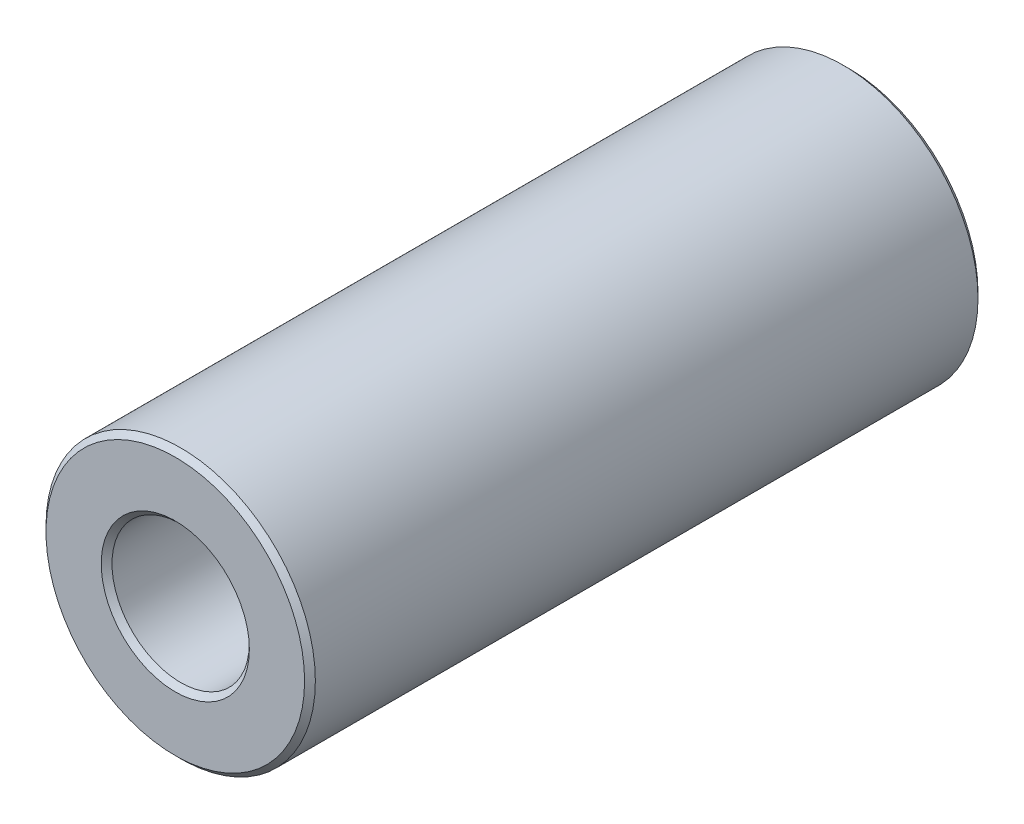
ISO-10303-21;
HEADER;
FILE_DESCRIPTION(('STEP AP214'),'2;1');
FILE_NAME('part.step','',(''),(''),'','','');
FILE_SCHEMA(('AUTOMOTIVE_DESIGN { 1 0 10303 214 1 1 1 1 }'));
ENDSEC;
DATA;
#1=APPLICATION_CONTEXT('core data for automotive mechanical design processes');
#2=APPLICATION_PROTOCOL_DEFINITION('international standard','automotive_design',2000,#1);
#3=PRODUCT_CONTEXT('',#1,'mechanical');
#4=PRODUCT('Part','Part','',(#3));
#5=PRODUCT_RELATED_PRODUCT_CATEGORY('part','',(#4));
#6=PRODUCT_DEFINITION_FORMATION('','',#4);
#7=PRODUCT_DEFINITION_CONTEXT('part definition',#1,'design');
#8=PRODUCT_DEFINITION('design','',#6,#7);
#9=PRODUCT_DEFINITION_SHAPE('','',#8);
#10=(LENGTH_UNIT() NAMED_UNIT(*) SI_UNIT(.MILLI.,.METRE.));
#11=(NAMED_UNIT(*) PLANE_ANGLE_UNIT() SI_UNIT($,.RADIAN.));
#12=(NAMED_UNIT(*) SI_UNIT($,.STERADIAN.) SOLID_ANGLE_UNIT());
#13=UNCERTAINTY_MEASURE_WITH_UNIT(LENGTH_MEASURE(1.E-05),#10,'distance_accuracy_value','');
#14=(GEOMETRIC_REPRESENTATION_CONTEXT(3) GLOBAL_UNCERTAINTY_ASSIGNED_CONTEXT((#13)) GLOBAL_UNIT_ASSIGNED_CONTEXT((#10,
#11,#12)) REPRESENTATION_CONTEXT('',''));
#15=CARTESIAN_POINT('',(0.,0.,0.));
#16=DIRECTION('',(0.,0.,1.));
#17=DIRECTION('',(1.,0.,0.));
#18=AXIS2_PLACEMENT_3D('',#15,#16,#17);
#19=CARTESIAN_POINT('',(0.,0.,25.));
#20=DIRECTION('',(0.,0.,1.));
#21=DIRECTION('',(1.,0.,0.));
#22=AXIS2_PLACEMENT_3D('',#19,#20,#21);
#23=PLANE('',#22);
#24=CARTESIAN_POINT('',(0.,0.,25.));
#25=DIRECTION('',(0.,0.,1.));
#26=DIRECTION('',(1.,0.,0.));
#27=AXIS2_PLACEMENT_3D('',#24,#25,#26);
#28=CIRCLE('',#27,2.75000000000001);
#29=CARTESIAN_POINT('',(2.75000000000001,0.,25.));
#30=VERTEX_POINT('',#29);
#31=EDGE_CURVE('E10',#30,#30,#28,.F.);
#32=ORIENTED_EDGE('',*,*,#31,.T.);
#33=EDGE_LOOP('',(#32));
#34=FACE_BOUND('',#33,.T.);
#35=CARTESIAN_POINT('',(0.,0.,25.));
#36=DIRECTION('',(0.,0.,1.));
#37=DIRECTION('',(1.,0.,0.));
#38=AXIS2_PLACEMENT_3D('',#35,#36,#37);
#39=CIRCLE('',#38,4.80000000000001);
#40=CARTESIAN_POINT('',(4.80000000000001,0.,25.));
#41=VERTEX_POINT('',#40);
#42=EDGE_CURVE('E38',#41,#41,#39,.T.);
#43=ORIENTED_EDGE('',*,*,#42,.T.);
#44=EDGE_LOOP('',(#43));
#45=FACE_BOUND('',#44,.T.);
#46=ADVANCED_FACE('F31',(#34,#45),#23,.T.);
#47=CARTESIAN_POINT('',(0.,0.,0.));
#48=DIRECTION('',(0.,0.,1.));
#49=DIRECTION('',(1.,0.,0.));
#50=AXIS2_PLACEMENT_3D('',#47,#48,#49);
#51=PLANE('',#50);
#52=CARTESIAN_POINT('',(0.,0.,0.));
#53=DIRECTION('',(0.,0.,1.));
#54=DIRECTION('',(1.,0.,0.));
#55=AXIS2_PLACEMENT_3D('',#52,#53,#54);
#56=CIRCLE('',#55,4.8);
#57=CARTESIAN_POINT('',(4.8,0.,0.));
#58=VERTEX_POINT('',#57);
#59=EDGE_CURVE('E51',#58,#58,#56,.F.);
#60=ORIENTED_EDGE('',*,*,#59,.T.);
#61=EDGE_LOOP('',(#60));
#62=FACE_BOUND('',#61,.T.);
#63=CARTESIAN_POINT('',(0.,0.,0.));
#64=DIRECTION('',(0.,0.,1.));
#65=DIRECTION('',(1.,0.,0.));
#66=AXIS2_PLACEMENT_3D('',#63,#64,#65);
#67=CIRCLE('',#66,2.75);
#68=CARTESIAN_POINT('',(2.75,0.,0.));
#69=VERTEX_POINT('',#68);
#70=EDGE_CURVE('E54',#69,#69,#67,.T.);
#71=ORIENTED_EDGE('',*,*,#70,.T.);
#72=EDGE_LOOP('',(#71));
#73=FACE_BOUND('',#72,.T.);
#74=ADVANCED_FACE('F75',(#62,#73),#51,.F.);
#75=CARTESIAN_POINT('',(0.,0.,25.));
#76=DIRECTION('',(0.,0.,-1.));
#77=DIRECTION('',(-1.,0.,0.));
#78=AXIS2_PLACEMENT_3D('',#75,#76,#77);
#79=CYLINDRICAL_SURFACE('',#78,5.);
#80=CARTESIAN_POINT('',(0.,0.,0.199999999999999));
#81=DIRECTION('',(0.,0.,1.));
#82=DIRECTION('',(1.,0.,0.));
#83=AXIS2_PLACEMENT_3D('',#80,#81,#82);
#84=CIRCLE('',#83,5.);
#85=CARTESIAN_POINT('',(5.,0.,0.199999999999999));
#86=VERTEX_POINT('',#85);
#87=EDGE_CURVE('E57',#86,#86,#84,.T.);
#88=ORIENTED_EDGE('',*,*,#87,.T.);
#89=EDGE_LOOP('',(#88));
#90=FACE_BOUND('',#89,.T.);
#91=CARTESIAN_POINT('',(0.,0.,24.8));
#92=DIRECTION('',(0.,0.,1.));
#93=DIRECTION('',(1.,0.,0.));
#94=AXIS2_PLACEMENT_3D('',#91,#92,#93);
#95=CIRCLE('',#94,5.);
#96=CARTESIAN_POINT('',(5.,0.,24.8));
#97=VERTEX_POINT('',#96);
#98=EDGE_CURVE('E60',#97,#97,#95,.F.);
#99=ORIENTED_EDGE('',*,*,#98,.T.);
#100=EDGE_LOOP('',(#99));
#101=FACE_BOUND('',#100,.T.);
#102=ADVANCED_FACE('F64',(#90,#101),#79,.T.);
#103=CARTESIAN_POINT('',(0.,0.,25.));
#104=DIRECTION('',(0.,0.,-1.));
#105=DIRECTION('',(-1.,0.,0.));
#106=AXIS2_PLACEMENT_3D('',#103,#104,#105);
#107=CYLINDRICAL_SURFACE('',#106,2.55);
#108=CARTESIAN_POINT('',(0.,0.,0.199999999999995));
#109=DIRECTION('',(0.,0.,1.));
#110=DIRECTION('',(1.,0.,0.));
#111=AXIS2_PLACEMENT_3D('',#108,#109,#110);
#112=CIRCLE('',#111,2.55);
#113=CARTESIAN_POINT('',(2.55,0.,0.199999999999995));
#114=VERTEX_POINT('',#113);
#115=EDGE_CURVE('E42',#114,#114,#112,.F.);
#116=ORIENTED_EDGE('',*,*,#115,.T.);
#117=EDGE_LOOP('',(#116));
#118=FACE_BOUND('',#117,.T.);
#119=CARTESIAN_POINT('',(0.,0.,24.8));
#120=DIRECTION('',(0.,0.,1.));
#121=DIRECTION('',(1.,0.,0.));
#122=AXIS2_PLACEMENT_3D('',#119,#120,#121);
#123=CIRCLE('',#122,2.55);
#124=CARTESIAN_POINT('',(2.55,0.,24.8));
#125=VERTEX_POINT('',#124);
#126=EDGE_CURVE('E46',#125,#125,#123,.T.);
#127=ORIENTED_EDGE('',*,*,#126,.T.);
#128=EDGE_LOOP('',(#127));
#129=FACE_BOUND('',#128,.T.);
#130=ADVANCED_FACE('F83',(#118,#129),#107,.F.);
#131=CARTESIAN_POINT('',(0.,0.,0.199999999999999));
#132=DIRECTION('',(0.,0.,1.));
#133=DIRECTION('',(1.,0.,0.));
#134=AXIS2_PLACEMENT_3D('',#131,#132,#133);
#135=CONICAL_SURFACE('',#134,5.,0.785398163397455);
#136=ORIENTED_EDGE('',*,*,#59,.F.);
#137=EDGE_LOOP('',(#136));
#138=FACE_BOUND('',#137,.T.);
#139=ORIENTED_EDGE('',*,*,#87,.F.);
#140=EDGE_LOOP('',(#139));
#141=FACE_BOUND('',#140,.T.);
#142=ADVANCED_FACE('F88',(#138,#141),#135,.T.);
#143=CARTESIAN_POINT('',(0.,0.,0.));
#144=DIRECTION('',(0.,0.,-1.));
#145=DIRECTION('',(-1.,0.,0.));
#146=AXIS2_PLACEMENT_3D('',#143,#144,#145);
#147=CONICAL_SURFACE('',#146,2.75,0.785398163397449);
#148=ORIENTED_EDGE('',*,*,#115,.F.);
#149=EDGE_LOOP('',(#148));
#150=FACE_BOUND('',#149,.T.);
#151=ORIENTED_EDGE('',*,*,#70,.F.);
#152=EDGE_LOOP('',(#151));
#153=FACE_BOUND('',#152,.T.);
#154=ADVANCED_FACE('F72',(#150,#153),#147,.F.);
#155=CARTESIAN_POINT('',(0.,0.,24.8));
#156=DIRECTION('',(0.,0.,1.));
#157=DIRECTION('',(1.,0.,0.));
#158=AXIS2_PLACEMENT_3D('',#155,#156,#157);
#159=CONICAL_SURFACE('',#158,2.55,0.785398163397458);
#160=ORIENTED_EDGE('',*,*,#31,.F.);
#161=EDGE_LOOP('',(#160));
#162=FACE_BOUND('',#161,.T.);
#163=ORIENTED_EDGE('',*,*,#126,.F.);
#164=EDGE_LOOP('',(#163));
#165=FACE_BOUND('',#164,.T.);
#166=ADVANCED_FACE('F68',(#162,#165),#159,.F.);
#167=CARTESIAN_POINT('',(0.,0.,25.));
#168=DIRECTION('',(0.,0.,-1.));
#169=DIRECTION('',(-1.,0.,0.));
#170=AXIS2_PLACEMENT_3D('',#167,#168,#169);
#171=CONICAL_SURFACE('',#170,4.80000000000001,0.785398163397438);
#172=ORIENTED_EDGE('',*,*,#98,.F.);
#173=EDGE_LOOP('',(#172));
#174=FACE_BOUND('',#173,.T.);
#175=ORIENTED_EDGE('',*,*,#42,.F.);
#176=EDGE_LOOP('',(#175));
#177=FACE_BOUND('',#176,.T.);
#178=ADVANCED_FACE('F33',(#174,#177),#171,.T.);
#179=CLOSED_SHELL('',(#46,#74,#102,#130,#142,#154,#166,#178));
#180=MANIFOLD_SOLID_BREP('B2',#179);
#181=ADVANCED_BREP_SHAPE_REPRESENTATION('',(#18,#180),#14);
#182=SHAPE_DEFINITION_REPRESENTATION(#9,#181);
ENDSEC;
END-ISO-10303-21;
